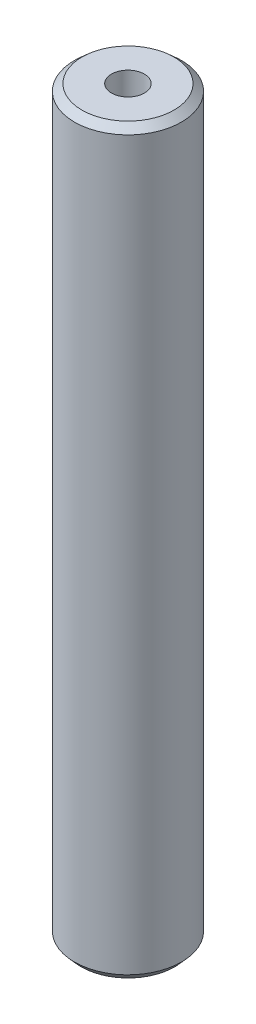
ISO-10303-21;
HEADER;
FILE_DESCRIPTION(('STEP AP214'),'2;1');
FILE_NAME('part.step','',(''),(''),'','','');
FILE_SCHEMA(('AUTOMOTIVE_DESIGN { 1 0 10303 214 1 1 1 1 }'));
ENDSEC;
DATA;
#1=APPLICATION_CONTEXT('core data for automotive mechanical design processes');
#2=APPLICATION_PROTOCOL_DEFINITION('international standard','automotive_design',2000,#1);
#3=PRODUCT_CONTEXT('',#1,'mechanical');
#4=PRODUCT('Part','Part','',(#3));
#5=PRODUCT_RELATED_PRODUCT_CATEGORY('part','',(#4));
#6=PRODUCT_DEFINITION_FORMATION('','',#4);
#7=PRODUCT_DEFINITION_CONTEXT('part definition',#1,'design');
#8=PRODUCT_DEFINITION('design','',#6,#7);
#9=PRODUCT_DEFINITION_SHAPE('','',#8);
#10=(LENGTH_UNIT() NAMED_UNIT(*) SI_UNIT(.MILLI.,.METRE.));
#11=(NAMED_UNIT(*) PLANE_ANGLE_UNIT() SI_UNIT($,.RADIAN.));
#12=(NAMED_UNIT(*) SI_UNIT($,.STERADIAN.) SOLID_ANGLE_UNIT());
#13=UNCERTAINTY_MEASURE_WITH_UNIT(LENGTH_MEASURE(1.E-05),#10,'distance_accuracy_value','');
#14=(GEOMETRIC_REPRESENTATION_CONTEXT(3) GLOBAL_UNCERTAINTY_ASSIGNED_CONTEXT((#13)) GLOBAL_UNIT_ASSIGNED_CONTEXT((#10,
#11,#12)) REPRESENTATION_CONTEXT('',''));
#15=CARTESIAN_POINT('',(0.,0.,0.));
#16=DIRECTION('',(0.,0.,1.));
#17=DIRECTION('',(1.,0.,0.));
#18=AXIS2_PLACEMENT_3D('',#15,#16,#17);
#19=CARTESIAN_POINT('',(0.,138.638155267323,0.));
#20=DIRECTION('',(0.,-1.,0.));
#21=DIRECTION('',(0.,0.,-1.));
#22=AXIS2_PLACEMENT_3D('',#19,#20,#21);
#23=CYLINDRICAL_SURFACE('',#22,10.);
#24=CARTESIAN_POINT('',(0.,137.39642302051,0.));
#25=DIRECTION('',(0.,1.,0.));
#26=DIRECTION('',(0.,0.,1.));
#27=AXIS2_PLACEMENT_3D('',#24,#25,#26);
#28=CIRCLE('',#27,10.);
#29=CARTESIAN_POINT('',(0.,137.39642302051,10.));
#30=VERTEX_POINT('',#29);
#31=EDGE_CURVE('E50',#30,#30,#28,.F.);
#32=ORIENTED_EDGE('',*,*,#31,.T.);
#33=EDGE_LOOP('',(#32));
#34=FACE_BOUND('',#33,.T.);
#35=CARTESIAN_POINT('',(0.,1.39525590893458,0.));
#36=DIRECTION('',(0.,1.,0.));
#37=DIRECTION('',(0.,0.,1.));
#38=AXIS2_PLACEMENT_3D('',#35,#36,#37);
#39=CIRCLE('',#38,10.);
#40=CARTESIAN_POINT('',(0.,1.39525590893458,10.));
#41=VERTEX_POINT('',#40);
#42=EDGE_CURVE('E51',#41,#41,#39,.T.);
#43=ORIENTED_EDGE('',*,*,#42,.T.);
#44=EDGE_LOOP('',(#43));
#45=FACE_BOUND('',#44,.T.);
#46=ADVANCED_FACE('F39',(#34,#45),#23,.T.);
#47=CARTESIAN_POINT('',(0.,138.638155267323,0.));
#48=DIRECTION('',(0.,1.,0.));
#49=DIRECTION('',(0.,0.,1.));
#50=AXIS2_PLACEMENT_3D('',#47,#48,#49);
#51=PLANE('',#50);
#52=CARTESIAN_POINT('',(0.,138.638155267323,0.));
#53=DIRECTION('',(0.,1.,0.));
#54=DIRECTION('',(0.,0.,1.));
#55=AXIS2_PLACEMENT_3D('',#52,#53,#54);
#56=CIRCLE('',#55,8.60474409106545);
#57=CARTESIAN_POINT('',(0.,138.638155267323,8.60474409106545));
#58=VERTEX_POINT('',#57);
#59=EDGE_CURVE('E54',#58,#58,#56,.T.);
#60=ORIENTED_EDGE('',*,*,#59,.T.);
#61=EDGE_LOOP('',(#60));
#62=FACE_BOUND('',#61,.T.);
#63=CARTESIAN_POINT('',(0.,138.638155267323,0.));
#64=DIRECTION('',(0.,1.,0.));
#65=DIRECTION('',(0.,0.,1.));
#66=AXIS2_PLACEMENT_3D('',#63,#64,#65);
#67=CIRCLE('',#66,3.07838671457273);
#68=CARTESIAN_POINT('',(0.,138.638155267323,3.07838671457273));
#69=VERTEX_POINT('',#68);
#70=EDGE_CURVE('E58',#69,#69,#67,.T.);
#71=ORIENTED_EDGE('',*,*,#70,.F.);
#72=EDGE_LOOP('',(#71));
#73=FACE_BOUND('',#72,.T.);
#74=ADVANCED_FACE('F69',(#62,#73),#51,.T.);
#75=CARTESIAN_POINT('',(0.,0.,0.));
#76=DIRECTION('',(0.,1.,0.));
#77=DIRECTION('',(0.,0.,1.));
#78=AXIS2_PLACEMENT_3D('',#75,#76,#77);
#79=PLANE('',#78);
#80=CARTESIAN_POINT('',(0.,0.,0.));
#81=DIRECTION('',(0.,1.,0.));
#82=DIRECTION('',(0.,0.,1.));
#83=AXIS2_PLACEMENT_3D('',#80,#81,#82);
#84=CIRCLE('',#83,8.75826775318762);
#85=CARTESIAN_POINT('',(0.,0.,8.75826775318762));
#86=VERTEX_POINT('',#85);
#87=EDGE_CURVE('E10',#86,#86,#84,.F.);
#88=ORIENTED_EDGE('',*,*,#87,.T.);
#89=EDGE_LOOP('',(#88));
#90=FACE_BOUND('',#89,.T.);
#91=CARTESIAN_POINT('',(0.,0.,0.));
#92=DIRECTION('',(0.,1.,0.));
#93=DIRECTION('',(0.,0.,1.));
#94=AXIS2_PLACEMENT_3D('',#91,#92,#93);
#95=CIRCLE('',#94,3.07838671457273);
#96=CARTESIAN_POINT('',(0.,0.,3.07838671457273));
#97=VERTEX_POINT('',#96);
#98=EDGE_CURVE('E63',#97,#97,#95,.T.);
#99=ORIENTED_EDGE('',*,*,#98,.T.);
#100=EDGE_LOOP('',(#99));
#101=FACE_BOUND('',#100,.T.);
#102=ADVANCED_FACE('F75',(#90,#101),#79,.F.);
#103=CARTESIAN_POINT('',(0.,138.638155267323,0.));
#104=DIRECTION('',(0.,-1.,0.));
#105=DIRECTION('',(0.,0.,-1.));
#106=AXIS2_PLACEMENT_3D('',#103,#104,#105);
#107=CYLINDRICAL_SURFACE('',#106,3.07838671457273);
#108=ORIENTED_EDGE('',*,*,#70,.T.);
#109=EDGE_LOOP('',(#108));
#110=FACE_BOUND('',#109,.T.);
#111=ORIENTED_EDGE('',*,*,#98,.F.);
#112=EDGE_LOOP('',(#111));
#113=FACE_BOUND('',#112,.T.);
#114=ADVANCED_FACE('F70',(#110,#113),#107,.F.);
#115=CARTESIAN_POINT('',(0.,138.638155267323,0.));
#116=DIRECTION('',(0.,-1.,0.));
#117=DIRECTION('',(0.,0.,-1.));
#118=AXIS2_PLACEMENT_3D('',#115,#116,#117);
#119=CONICAL_SURFACE('',#118,8.60474409106545,0.843551840759055);
#120=ORIENTED_EDGE('',*,*,#31,.F.);
#121=EDGE_LOOP('',(#120));
#122=FACE_BOUND('',#121,.T.);
#123=ORIENTED_EDGE('',*,*,#59,.F.);
#124=EDGE_LOOP('',(#123));
#125=FACE_BOUND('',#124,.T.);
#126=ADVANCED_FACE('F81',(#122,#125),#119,.T.);
#127=CARTESIAN_POINT('',(0.,1.39525590893458,0.));
#128=DIRECTION('',(0.,1.,0.));
#129=DIRECTION('',(0.,0.,1.));
#130=AXIS2_PLACEMENT_3D('',#127,#128,#129);
#131=CONICAL_SURFACE('',#130,10.,0.727244486035836);
#132=CARTESIAN_POINT('',(0.,0.,8.75826775318762));
#133=CARTESIAN_POINT('',(0.,0.0145339157180685,8.77120246409192));
#134=CARTESIAN_POINT('',(0.,0.029067831436137,8.78413717499621));
#135=CARTESIAN_POINT('',(0.,0.058135662872274,8.81000659680481));
#136=CARTESIAN_POINT('',(0.,0.0726695785903425,8.8229413077091));
#137=CARTESIAN_POINT('',(0.,0.101737410026479,8.84881072951769));
#138=CARTESIAN_POINT('',(0.,0.116271325744548,8.86174544042199));
#139=CARTESIAN_POINT('',(0.,0.145339157180685,8.88761486223058));
#140=CARTESIAN_POINT('',(0.,0.159873072898754,8.90054957313487));
#141=CARTESIAN_POINT('',(0.,0.188940904334891,8.92641899494347));
#142=CARTESIAN_POINT('',(0.,0.203474820052959,8.93935370584776));
#143=CARTESIAN_POINT('',(0.,0.232542651489096,8.96522312765635));
#144=CARTESIAN_POINT('',(0.,0.247076567207165,8.97815783856065));
#145=CARTESIAN_POINT('',(0.,0.276144398643302,9.00402726036924));
#146=CARTESIAN_POINT('',(0.,0.29067831436137,9.01696197127353));
#147=CARTESIAN_POINT('',(0.,0.319746145797507,9.04283139308212));
#148=CARTESIAN_POINT('',(0.,0.334280061515576,9.05576610398642));
#149=CARTESIAN_POINT('',(0.,0.363347892951713,9.08163552579501));
#150=CARTESIAN_POINT('',(0.,0.377881808669782,9.09457023669931));
#151=CARTESIAN_POINT('',(0.,0.406949640105918,9.1204396585079));
#152=CARTESIAN_POINT('',(0.,0.421483555823987,9.13337436941219));
#153=CARTESIAN_POINT('',(0.,0.450551387260124,9.15924379122079));
#154=CARTESIAN_POINT('',(0.,0.465085302978193,9.17217850212508));
#155=CARTESIAN_POINT('',(0.,0.49415313441433,9.19804792393367));
#156=CARTESIAN_POINT('',(0.,0.508687050132398,9.21098263483797));
#157=CARTESIAN_POINT('',(0.,0.537754881568535,9.23685205664656));
#158=CARTESIAN_POINT('',(0.,0.552288797286604,9.24978676755086));
#159=CARTESIAN_POINT('',(0.,0.581356628722741,9.27565618935945));
#160=CARTESIAN_POINT('',(0.,0.595890544440809,9.28859090026374));
#161=CARTESIAN_POINT('',(0.,0.624958375876946,9.31446032207233));
#162=CARTESIAN_POINT('',(0.,0.639492291595015,9.32739503297663));
#163=CARTESIAN_POINT('',(0.,0.668560123031152,9.35326445478522));
#164=CARTESIAN_POINT('',(0.,0.683094038749221,9.36619916568952));
#165=CARTESIAN_POINT('',(0.,0.712161870185358,9.39206858749811));
#166=CARTESIAN_POINT('',(0.,0.726695785903426,9.4050032984024));
#167=CARTESIAN_POINT('',(0.,0.755763617339563,9.43087272021099));
#168=CARTESIAN_POINT('',(0.,0.770297533057632,9.44380743111529));
#169=CARTESIAN_POINT('',(0.,0.799365364493769,9.46967685292388));
#170=CARTESIAN_POINT('',(0.,0.813899280211837,9.48261156382818));
#171=CARTESIAN_POINT('',(0.,0.842967111647974,9.50848098563677));
#172=CARTESIAN_POINT('',(0.,0.857501027366043,9.52141569654106));
#173=CARTESIAN_POINT('',(0.,0.88656885880218,9.54728511834965));
#174=CARTESIAN_POINT('',(0.,0.901102774520248,9.56021982925395));
#175=CARTESIAN_POINT('',(0.,0.930170605956386,9.58608925106254));
#176=CARTESIAN_POINT('',(0.,0.944704521674454,9.59902396196684));
#177=CARTESIAN_POINT('',(0.,0.973772353110591,9.62489338377543));
#178=CARTESIAN_POINT('',(0.,0.988306268828659,9.63782809467972));
#179=CARTESIAN_POINT('',(0.,1.0173741002648,9.66369751648831));
#180=CARTESIAN_POINT('',(0.,1.03190801598287,9.67663222739261));
#181=CARTESIAN_POINT('',(0.,1.060975847419,9.7025016492012));
#182=CARTESIAN_POINT('',(0.,1.07550976313707,9.7154363601055));
#183=CARTESIAN_POINT('',(0.,1.10457759457321,9.74130578191409));
#184=CARTESIAN_POINT('',(0.,1.11911151029128,9.75424049281838));
#185=CARTESIAN_POINT('',(0.,1.14817934172741,9.78010991462697));
#186=CARTESIAN_POINT('',(0.,1.16271325744548,9.79304462553127));
#187=CARTESIAN_POINT('',(0.,1.19178108888162,9.81891404733986));
#188=CARTESIAN_POINT('',(0.,1.20631500459969,9.83184875824416));
#189=CARTESIAN_POINT('',(0.,1.23538283603582,9.85771818005275));
#190=CARTESIAN_POINT('',(0.,1.24991675175389,9.87065289095704));
#191=CARTESIAN_POINT('',(0.,1.27898458319003,9.89652231276564));
#192=CARTESIAN_POINT('',(0.,1.2935184989081,9.90945702366993));
#193=CARTESIAN_POINT('',(0.,1.32258633034424,9.93532644547852));
#194=CARTESIAN_POINT('',(0.,1.3371202460623,9.94826115638282));
#195=CARTESIAN_POINT('',(0.,1.36618807749844,9.97413057819141));
#196=CARTESIAN_POINT('',(0.,1.38072199321651,9.9870652890957));
#197=CARTESIAN_POINT('',(0.,1.39525590893458,10.));
#198=B_SPLINE_CURVE_WITH_KNOTS('',3,(#132,#133,#134,#135,#136,#137,#138,#139,#140,#141,#142,
#143,#144,#145,#146,#147,#148,#149,#150,#151,#152,#153,#154,#155,#156,#157,#158,#159,#160,#161,
#162,#163,#164,#165,#166,#167,#168,#169,#170,#171,#172,#173,#174,#175,#176,#177,#178,#179,#180,
#181,#182,#183,#184,#185,#186,#187,#188,#189,#190,#191,#192,#193,#194,#195,#196,#197),
.UNSPECIFIED.,.F.,.F.,(4,2,2,2,2,2,2,2,2,2,2,2,2,2,2,2,2,2,2,2,2,2,2,2,2,2,2,2,2,2,2,2,4),(0.,
0.0583684252871235,0.116736850574248,0.175105275861373,0.233473701148496,0.291842126435621,
0.350210551722745,0.408578977009869,0.466947402296993,0.525315827584118,0.583684252871242,
0.642052678158366,0.700421103445491,0.758789528732615,0.817157954019739,0.875526379306864,
0.933894804593987,0.992263229881112,1.05063165516824,1.10900008045536,1.16736850574248,
1.22573693102961,1.28410535631673,1.34247378160386,1.40084220689098,1.45921063217811,
1.51757905746523,1.57594748275235,1.63431590803948,1.6926843333266,1.75105275861373,
1.80942118390085,1.86778960918798),.UNSPECIFIED.);
#199=EDGE_CURVE('BSEAM45',#86,#41,#198,.T.);
#200=ORIENTED_EDGE('',*,*,#87,.F.);
#201=ORIENTED_EDGE('',*,*,#42,.F.);
#202=ORIENTED_EDGE('',*,*,#199,.T.);
#203=ORIENTED_EDGE('',*,*,#199,.F.);
#204=EDGE_LOOP('',(#200,#202,#201,#203));
#205=FACE_BOUND('',#204,.T.);
#206=ADVANCED_FACE('F45',(#205),#131,.T.);
#207=CLOSED_SHELL('',(#46,#74,#102,#114,#126,#206));
#208=MANIFOLD_SOLID_BREP('B2',#207);
#209=ADVANCED_BREP_SHAPE_REPRESENTATION('',(#18,#208),#14);
#210=SHAPE_DEFINITION_REPRESENTATION(#9,#209);
ENDSEC;
END-ISO-10303-21;
